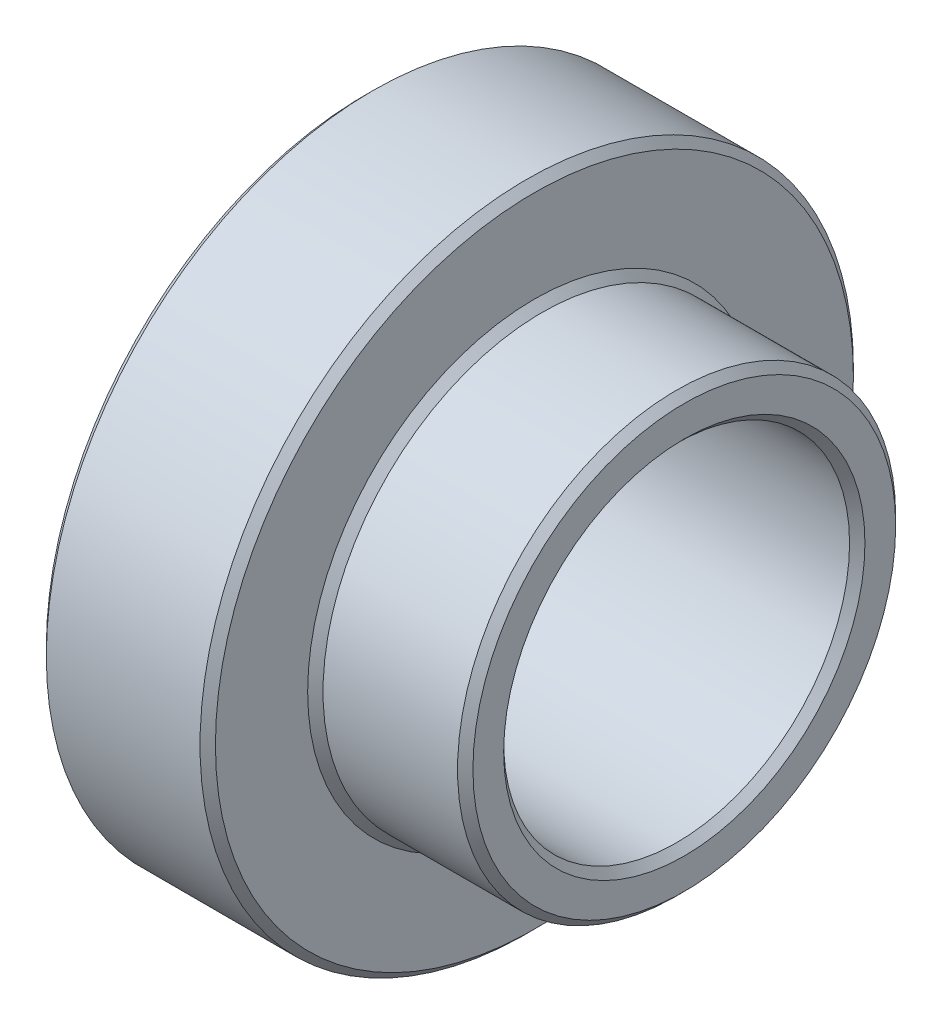
ISO-10303-21;
HEADER;
FILE_DESCRIPTION(('STEP AP214'),'2;1');
FILE_NAME('part.step','',(''),(''),'','','');
FILE_SCHEMA(('AUTOMOTIVE_DESIGN { 1 0 10303 214 1 1 1 1 }'));
ENDSEC;
DATA;
#1=APPLICATION_CONTEXT('core data for automotive mechanical design processes');
#2=APPLICATION_PROTOCOL_DEFINITION('international standard','automotive_design',2000,#1);
#3=PRODUCT_CONTEXT('',#1,'mechanical');
#4=PRODUCT('Part','Part','',(#3));
#5=PRODUCT_RELATED_PRODUCT_CATEGORY('part','',(#4));
#6=PRODUCT_DEFINITION_FORMATION('','',#4);
#7=PRODUCT_DEFINITION_CONTEXT('part definition',#1,'design');
#8=PRODUCT_DEFINITION('design','',#6,#7);
#9=PRODUCT_DEFINITION_SHAPE('','',#8);
#10=(LENGTH_UNIT() NAMED_UNIT(*) SI_UNIT(.MILLI.,.METRE.));
#11=(NAMED_UNIT(*) PLANE_ANGLE_UNIT() SI_UNIT($,.RADIAN.));
#12=(NAMED_UNIT(*) SI_UNIT($,.STERADIAN.) SOLID_ANGLE_UNIT());
#13=UNCERTAINTY_MEASURE_WITH_UNIT(LENGTH_MEASURE(1.E-05),#10,'distance_accuracy_value','');
#14=(GEOMETRIC_REPRESENTATION_CONTEXT(3) GLOBAL_UNCERTAINTY_ASSIGNED_CONTEXT((#13)) GLOBAL_UNIT_ASSIGNED_CONTEXT((#10,
#11,#12)) REPRESENTATION_CONTEXT('',''));
#15=CARTESIAN_POINT('',(0.,0.,0.));
#16=DIRECTION('',(0.,0.,1.));
#17=DIRECTION('',(1.,0.,0.));
#18=AXIS2_PLACEMENT_3D('',#15,#16,#17);
#19=CARTESIAN_POINT('',(43.575,0.,0.));
#20=DIRECTION('',(1.,0.,0.));
#21=DIRECTION('',(0.,0.,-1.));
#22=AXIS2_PLACEMENT_3D('',#19,#20,#21);
#23=CYLINDRICAL_SURFACE('',#22,42.5);
#24=CARTESIAN_POINT('',(1.00000000000001,0.,0.));
#25=DIRECTION('',(-1.,0.,0.));
#26=DIRECTION('',(0.,0.,1.));
#27=AXIS2_PLACEMENT_3D('',#24,#25,#26);
#28=CIRCLE('',#27,42.5);
#29=CARTESIAN_POINT('',(1.00000000000001,0.,42.5));
#30=VERTEX_POINT('',#29);
#31=EDGE_CURVE('E10',#30,#30,#28,.F.);
#32=ORIENTED_EDGE('',*,*,#31,.T.);
#33=EDGE_LOOP('',(#32));
#34=FACE_BOUND('',#33,.T.);
#35=CARTESIAN_POINT('',(21.,0.,0.));
#36=DIRECTION('',(1.,0.,0.));
#37=DIRECTION('',(0.,0.,-1.));
#38=AXIS2_PLACEMENT_3D('',#35,#36,#37);
#39=CIRCLE('',#38,42.5);
#40=CARTESIAN_POINT('',(21.,0.,-42.5));
#41=VERTEX_POINT('',#40);
#42=EDGE_CURVE('E42',#41,#41,#39,.F.);
#43=ORIENTED_EDGE('',*,*,#42,.T.);
#44=EDGE_LOOP('',(#43));
#45=FACE_BOUND('',#44,.T.);
#46=ADVANCED_FACE('F34',(#34,#45),#23,.T.);
#47=CARTESIAN_POINT('',(22.,42.5,0.));
#48=DIRECTION('',(1.,0.,0.));
#49=DIRECTION('',(0.,0.,-1.));
#50=AXIS2_PLACEMENT_3D('',#47,#48,#49);
#51=PLANE('',#50);
#52=CARTESIAN_POINT('',(22.,0.,0.));
#53=DIRECTION('',(1.,0.,0.));
#54=DIRECTION('',(0.,0.,-1.));
#55=AXIS2_PLACEMENT_3D('',#52,#53,#54);
#56=CIRCLE('',#55,29.5);
#57=CARTESIAN_POINT('',(22.,0.,-29.5));
#58=VERTEX_POINT('',#57);
#59=EDGE_CURVE('E46',#58,#58,#56,.F.);
#60=ORIENTED_EDGE('',*,*,#59,.T.);
#61=EDGE_LOOP('',(#60));
#62=FACE_BOUND('',#61,.T.);
#63=CARTESIAN_POINT('',(22.,0.,0.));
#64=DIRECTION('',(1.,0.,0.));
#65=DIRECTION('',(0.,0.,-1.));
#66=AXIS2_PLACEMENT_3D('',#63,#64,#65);
#67=CIRCLE('',#66,41.5);
#68=CARTESIAN_POINT('',(22.,0.,-41.5));
#69=VERTEX_POINT('',#68);
#70=EDGE_CURVE('E50',#69,#69,#67,.T.);
#71=ORIENTED_EDGE('',*,*,#70,.T.);
#72=EDGE_LOOP('',(#71));
#73=FACE_BOUND('',#72,.T.);
#74=ADVANCED_FACE('F96',(#62,#73),#51,.T.);
#75=CARTESIAN_POINT('',(43.575,0.,0.));
#76=DIRECTION('',(1.,0.,0.));
#77=DIRECTION('',(0.,0.,-1.));
#78=AXIS2_PLACEMENT_3D('',#75,#76,#77);
#79=CYLINDRICAL_SURFACE('',#78,28.5);
#80=CARTESIAN_POINT('',(40.5,0.,0.));
#81=DIRECTION('',(1.,0.,0.));
#82=DIRECTION('',(0.,0.,-1.));
#83=AXIS2_PLACEMENT_3D('',#80,#81,#82);
#84=CIRCLE('',#83,28.5);
#85=CARTESIAN_POINT('',(40.5,0.,-28.5));
#86=VERTEX_POINT('',#85);
#87=EDGE_CURVE('E55',#86,#86,#84,.F.);
#88=ORIENTED_EDGE('',*,*,#87,.T.);
#89=EDGE_LOOP('',(#88));
#90=FACE_BOUND('',#89,.T.);
#91=CARTESIAN_POINT('',(23.,0.,0.));
#92=DIRECTION('',(1.,0.,0.));
#93=DIRECTION('',(0.,0.,-1.));
#94=AXIS2_PLACEMENT_3D('',#91,#92,#93);
#95=CIRCLE('',#94,28.5);
#96=CARTESIAN_POINT('',(23.,0.,-28.5));
#97=VERTEX_POINT('',#96);
#98=EDGE_CURVE('E58',#97,#97,#95,.T.);
#99=ORIENTED_EDGE('',*,*,#98,.T.);
#100=EDGE_LOOP('',(#99));
#101=FACE_BOUND('',#100,.T.);
#102=ADVANCED_FACE('F101',(#90,#101),#79,.T.);
#103=CARTESIAN_POINT('',(41.5,28.5,0.));
#104=DIRECTION('',(1.,0.,0.));
#105=DIRECTION('',(0.,0.,-1.));
#106=AXIS2_PLACEMENT_3D('',#103,#104,#105);
#107=PLANE('',#106);
#108=CARTESIAN_POINT('',(41.5,0.,0.));
#109=DIRECTION('',(1.,0.,0.));
#110=DIRECTION('',(0.,0.,-1.));
#111=AXIS2_PLACEMENT_3D('',#108,#109,#110);
#112=CIRCLE('',#111,23.5);
#113=CARTESIAN_POINT('',(41.5,0.,-23.5));
#114=VERTEX_POINT('',#113);
#115=EDGE_CURVE('E61',#114,#114,#112,.F.);
#116=ORIENTED_EDGE('',*,*,#115,.T.);
#117=EDGE_LOOP('',(#116));
#118=FACE_BOUND('',#117,.T.);
#119=CARTESIAN_POINT('',(41.5,0.,0.));
#120=DIRECTION('',(1.,0.,0.));
#121=DIRECTION('',(0.,0.,-1.));
#122=AXIS2_PLACEMENT_3D('',#119,#120,#121);
#123=CIRCLE('',#122,27.5);
#124=CARTESIAN_POINT('',(41.5,0.,-27.5));
#125=VERTEX_POINT('',#124);
#126=EDGE_CURVE('E64',#125,#125,#123,.T.);
#127=ORIENTED_EDGE('',*,*,#126,.T.);
#128=EDGE_LOOP('',(#127));
#129=FACE_BOUND('',#128,.T.);
#130=ADVANCED_FACE('F138',(#118,#129),#107,.T.);
#131=CARTESIAN_POINT('',(43.575,0.,0.));
#132=DIRECTION('',(1.,0.,0.));
#133=DIRECTION('',(0.,0.,-1.));
#134=AXIS2_PLACEMENT_3D('',#131,#132,#133);
#135=CYLINDRICAL_SURFACE('',#134,22.5);
#136=CARTESIAN_POINT('',(0.999999999999994,0.,0.));
#137=DIRECTION('',(-1.,0.,0.));
#138=DIRECTION('',(0.,0.,1.));
#139=AXIS2_PLACEMENT_3D('',#136,#137,#138);
#140=CIRCLE('',#139,22.5);
#141=CARTESIAN_POINT('',(0.999999999999994,0.,22.5));
#142=VERTEX_POINT('',#141);
#143=EDGE_CURVE('E67',#142,#142,#140,.T.);
#144=ORIENTED_EDGE('',*,*,#143,.T.);
#145=EDGE_LOOP('',(#144));
#146=FACE_BOUND('',#145,.T.);
#147=CARTESIAN_POINT('',(40.5,0.,0.));
#148=DIRECTION('',(1.,0.,0.));
#149=DIRECTION('',(0.,0.,-1.));
#150=AXIS2_PLACEMENT_3D('',#147,#148,#149);
#151=CIRCLE('',#150,22.5);
#152=CARTESIAN_POINT('',(40.5,0.,-22.5));
#153=VERTEX_POINT('',#152);
#154=EDGE_CURVE('E70',#153,#153,#151,.T.);
#155=ORIENTED_EDGE('',*,*,#154,.T.);
#156=EDGE_LOOP('',(#155));
#157=FACE_BOUND('',#156,.T.);
#158=ADVANCED_FACE('F140',(#146,#157),#135,.F.);
#159=CARTESIAN_POINT('',(0.,22.5,0.));
#160=DIRECTION('',(-1.,0.,0.));
#161=DIRECTION('',(0.,0.,1.));
#162=AXIS2_PLACEMENT_3D('',#159,#160,#161);
#163=PLANE('',#162);
#164=CARTESIAN_POINT('',(0.,0.,0.));
#165=DIRECTION('',(-1.,0.,0.));
#166=DIRECTION('',(0.,0.,1.));
#167=AXIS2_PLACEMENT_3D('',#164,#165,#166);
#168=CIRCLE('',#167,23.5);
#169=CARTESIAN_POINT('',(0.,0.,23.5));
#170=VERTEX_POINT('',#169);
#171=EDGE_CURVE('E73',#170,#170,#168,.F.);
#172=ORIENTED_EDGE('',*,*,#171,.T.);
#173=EDGE_LOOP('',(#172));
#174=FACE_BOUND('',#173,.T.);
#175=CARTESIAN_POINT('',(0.,0.,0.));
#176=DIRECTION('',(-1.,0.,0.));
#177=DIRECTION('',(0.,0.,1.));
#178=AXIS2_PLACEMENT_3D('',#175,#176,#177);
#179=CIRCLE('',#178,41.5);
#180=CARTESIAN_POINT('',(0.,0.,41.5));
#181=VERTEX_POINT('',#180);
#182=EDGE_CURVE('E76',#181,#181,#179,.T.);
#183=ORIENTED_EDGE('',*,*,#182,.T.);
#184=EDGE_LOOP('',(#183));
#185=FACE_BOUND('',#184,.T.);
#186=ADVANCED_FACE('F80',(#174,#185),#163,.T.);
#187=CARTESIAN_POINT('',(0.,0.,0.));
#188=DIRECTION('',(-1.,0.,0.));
#189=DIRECTION('',(0.,0.,1.));
#190=AXIS2_PLACEMENT_3D('',#187,#188,#189);
#191=CONICAL_SURFACE('',#190,23.5,0.785398163397457);
#192=ORIENTED_EDGE('',*,*,#143,.F.);
#193=EDGE_LOOP('',(#192));
#194=FACE_BOUND('',#193,.T.);
#195=ORIENTED_EDGE('',*,*,#171,.F.);
#196=EDGE_LOOP('',(#195));
#197=FACE_BOUND('',#196,.T.);
#198=ADVANCED_FACE('F107',(#194,#197),#191,.F.);
#199=CARTESIAN_POINT('',(40.5,0.,0.));
#200=DIRECTION('',(1.,0.,0.));
#201=DIRECTION('',(0.,0.,-1.));
#202=AXIS2_PLACEMENT_3D('',#199,#200,#201);
#203=CONICAL_SURFACE('',#202,22.5,0.785398163397455);
#204=ORIENTED_EDGE('',*,*,#115,.F.);
#205=EDGE_LOOP('',(#204));
#206=FACE_BOUND('',#205,.T.);
#207=ORIENTED_EDGE('',*,*,#154,.F.);
#208=EDGE_LOOP('',(#207));
#209=FACE_BOUND('',#208,.T.);
#210=ADVANCED_FACE('F113',(#206,#209),#203,.F.);
#211=CARTESIAN_POINT('',(41.5,0.,0.));
#212=DIRECTION('',(-1.,0.,0.));
#213=DIRECTION('',(0.,0.,1.));
#214=AXIS2_PLACEMENT_3D('',#211,#212,#213);
#215=CONICAL_SURFACE('',#214,27.5,0.785398163397447);
#216=ORIENTED_EDGE('',*,*,#87,.F.);
#217=EDGE_LOOP('',(#216));
#218=FACE_BOUND('',#217,.T.);
#219=ORIENTED_EDGE('',*,*,#126,.F.);
#220=EDGE_LOOP('',(#219));
#221=FACE_BOUND('',#220,.T.);
#222=ADVANCED_FACE('F91',(#218,#221),#215,.T.);
#223=CARTESIAN_POINT('',(23.,0.,0.));
#224=DIRECTION('',(-1.,0.,0.));
#225=DIRECTION('',(0.,0.,1.));
#226=AXIS2_PLACEMENT_3D('',#223,#224,#225);
#227=CONICAL_SURFACE('',#226,28.5,0.785398163397441);
#228=ORIENTED_EDGE('',*,*,#59,.F.);
#229=EDGE_LOOP('',(#228));
#230=FACE_BOUND('',#229,.T.);
#231=ORIENTED_EDGE('',*,*,#98,.F.);
#232=EDGE_LOOP('',(#231));
#233=FACE_BOUND('',#232,.T.);
#234=ADVANCED_FACE('F85',(#230,#233),#227,.T.);
#235=CARTESIAN_POINT('',(1.00000000000001,0.,0.));
#236=DIRECTION('',(1.,0.,0.));
#237=DIRECTION('',(0.,0.,-1.));
#238=AXIS2_PLACEMENT_3D('',#235,#236,#237);
#239=CONICAL_SURFACE('',#238,42.5,0.785398163397445);
#240=ORIENTED_EDGE('',*,*,#182,.F.);
#241=EDGE_LOOP('',(#240));
#242=FACE_BOUND('',#241,.T.);
#243=ORIENTED_EDGE('',*,*,#31,.F.);
#244=EDGE_LOOP('',(#243));
#245=FACE_BOUND('',#244,.T.);
#246=ADVANCED_FACE('F82',(#242,#245),#239,.T.);
#247=CARTESIAN_POINT('',(22.,0.,0.));
#248=DIRECTION('',(-1.,0.,0.));
#249=DIRECTION('',(0.,0.,1.));
#250=AXIS2_PLACEMENT_3D('',#247,#248,#249);
#251=CONICAL_SURFACE('',#250,41.5,0.785398163397448);
#252=ORIENTED_EDGE('',*,*,#42,.F.);
#253=EDGE_LOOP('',(#252));
#254=FACE_BOUND('',#253,.T.);
#255=ORIENTED_EDGE('',*,*,#70,.F.);
#256=EDGE_LOOP('',(#255));
#257=FACE_BOUND('',#256,.T.);
#258=ADVANCED_FACE('F37',(#254,#257),#251,.T.);
#259=CLOSED_SHELL('',(#46,#74,#102,#130,#158,#186,#198,#210,#222,#234,#246,#258));
#260=MANIFOLD_SOLID_BREP('B2',#259);
#261=ADVANCED_BREP_SHAPE_REPRESENTATION('',(#18,#260),#14);
#262=SHAPE_DEFINITION_REPRESENTATION(#9,#261);
ENDSEC;
END-ISO-10303-21;
